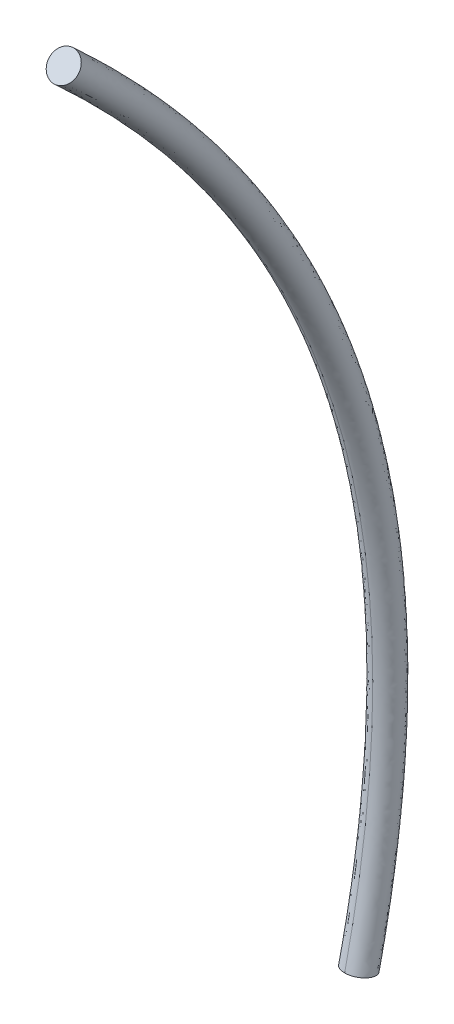
ISO-10303-21;
HEADER;
FILE_DESCRIPTION(('STEP AP214'),'2;1');
FILE_NAME('part.step','',(''),(''),'','','');
FILE_SCHEMA(('AUTOMOTIVE_DESIGN { 1 0 10303 214 1 1 1 1 }'));
ENDSEC;
DATA;
#1=APPLICATION_CONTEXT('core data for automotive mechanical design processes');
#2=APPLICATION_PROTOCOL_DEFINITION('international standard','automotive_design',2000,#1);
#3=PRODUCT_CONTEXT('',#1,'mechanical');
#4=PRODUCT('Part','Part','',(#3));
#5=PRODUCT_RELATED_PRODUCT_CATEGORY('part','',(#4));
#6=PRODUCT_DEFINITION_FORMATION('','',#4);
#7=PRODUCT_DEFINITION_CONTEXT('part definition',#1,'design');
#8=PRODUCT_DEFINITION('design','',#6,#7);
#9=PRODUCT_DEFINITION_SHAPE('','',#8);
#10=(LENGTH_UNIT() NAMED_UNIT(*) SI_UNIT(.MILLI.,.METRE.));
#11=(NAMED_UNIT(*) PLANE_ANGLE_UNIT() SI_UNIT($,.RADIAN.));
#12=(NAMED_UNIT(*) SI_UNIT($,.STERADIAN.) SOLID_ANGLE_UNIT());
#13=UNCERTAINTY_MEASURE_WITH_UNIT(LENGTH_MEASURE(1.E-05),#10,'distance_accuracy_value','');
#14=(GEOMETRIC_REPRESENTATION_CONTEXT(3) GLOBAL_UNCERTAINTY_ASSIGNED_CONTEXT((#13)) GLOBAL_UNIT_ASSIGNED_CONTEXT((#10,
#11,#12)) REPRESENTATION_CONTEXT('',''));
#15=CARTESIAN_POINT('',(0.,0.,0.));
#16=DIRECTION('',(0.,0.,1.));
#17=DIRECTION('',(1.,0.,0.));
#18=AXIS2_PLACEMENT_3D('',#15,#16,#17);
#19=CARTESIAN_POINT('',(-71.89158931535,31.2153070087,3.940002599999));
#20=DIRECTION('',(-3.37450176042513E-05,0.676622103447027,0.736330447549329));
#21=DIRECTION('',(0.,-0.736330447968568,0.67662210383227));
#22=AXIS2_PLACEMENT_3D('',#19,#20,#21);
#23=PLANE('',#22);
#24=CARTESIAN_POINT('',(-71.8915801262598,31.0312243970435,4.10915812606981));
#25=CARTESIAN_POINT('',(-71.9056443273846,31.0312149004336,4.10916620806537));
#26=CARTESIAN_POINT('',(-71.9197050075633,31.0320963525736,4.10835558766947));
#27=CARTESIAN_POINT('',(-71.9474187056116,31.0355763672693,4.1051564940145));
#28=CARTESIAN_POINT('',(-71.9610720142052,31.0381736730972,4.10276917556319));
#29=CARTESIAN_POINT('',(-71.9875982261411,31.0450223704149,4.09647461701565));
#30=CARTESIAN_POINT('',(-72.0004707642019,31.0492745293283,4.09256667174221));
#31=CARTESIAN_POINT('',(-72.0250612478118,31.0593084061478,4.08334530561743));
#32=CARTESIAN_POINT('',(-72.0367794195704,31.065089823559,4.07803216088385));
#33=CARTESIAN_POINT('',(-72.0587246528069,31.0780153155504,4.06615377917264));
#34=CARTESIAN_POINT('',(-72.0689526084492,31.0851585670084,4.05958929853001));
#35=CARTESIAN_POINT('',(-72.0876491179524,31.100618221931,4.04538239566298));
#36=CARTESIAN_POINT('',(-72.0961151845554,31.1089362564185,4.03773847478781));
#37=CARTESIAN_POINT('',(-72.1110187933412,31.1264893040948,4.02160810424195));
#38=CARTESIAN_POINT('',(-72.1174591050374,31.1357230424464,4.01312282590617));
#39=CARTESIAN_POINT('',(-72.1281517258305,31.1548682701707,3.99552957668017));
#40=CARTESIAN_POINT('',(-72.1324010741075,31.1647806562812,3.98642078190338));
#41=CARTESIAN_POINT('',(-72.1385756928086,31.1849834075447,3.96785596978209));
#42=CARTESIAN_POINT('',(-72.1405025254876,31.1952735138154,3.95840019025569));
#43=CARTESIAN_POINT('',(-72.1419826697084,31.2159459210752,3.93940402124288));
#44=CARTESIAN_POINT('',(-72.1415359811961,31.2263282220664,3.92986363175454));
#45=CARTESIAN_POINT('',(-72.1382806229167,31.2468972613656,3.91096266571314));
#46=CARTESIAN_POINT('',(-72.1354703630354,31.2570838632951,3.90160221455266));
#47=CARTESIAN_POINT('',(-72.1275710457406,31.2769512561954,3.88334621188929));
#48=CARTESIAN_POINT('',(-72.1224850600288,31.2866327093962,3.87445005171519));
#49=CARTESIAN_POINT('',(-72.1101707567415,31.3052429786498,3.85734943605592));
#50=CARTESIAN_POINT('',(-72.1029395068276,31.3141707428964,3.84914594722146));
#51=CARTESIAN_POINT('',(-72.0865543833166,31.3309930460379,3.83368849974252));
#52=CARTESIAN_POINT('',(-72.0774032097909,31.3388890109529,3.82643323058886));
#53=CARTESIAN_POINT('',(-72.0574175262046,31.3534488746673,3.81305492845842));
#54=CARTESIAN_POINT('',(-72.0465806739479,31.3601110304794,3.80693349723923));
#55=CARTESIAN_POINT('',(-72.0235569982175,31.3719916182258,3.79601735033321));
#56=CARTESIAN_POINT('',(-72.0113720903986,31.3772120629147,3.79122078501643));
#57=CARTESIAN_POINT('',(-71.9859679017957,31.3860806722069,3.78307248715765));
#58=CARTESIAN_POINT('',(-71.9727471268988,31.3897265144128,3.77972288876047));
#59=CARTESIAN_POINT('',(-71.9456784626663,31.3953250605954,3.77457956394699));
#60=CARTESIAN_POINT('',(-71.9318315653517,31.3972803505388,3.77278346121224));
#61=CARTESIAN_POINT('',(-71.9091402262477,31.3990498083704,3.77115852696657));
#62=CARTESIAN_POINT('',(-71.9003670645482,31.3993919319967,3.77084454788564));
#63=CARTESIAN_POINT('',(-71.8915984960603,31.3993896203589,3.77084707392642));
#64=B_SPLINE_CURVE_WITH_KNOTS('',3,(#24,#25,#26,#27,#28,#29,#30,#31,#32,#33,#34,#35,#36,#37,#38,
#39,#40,#41,#42,#43,#44,#45,#46,#47,#48,#49,#50,#51,#52,#53,#54,#55,#56,#57,#58,#59,#60,#61,#62,
#63),.UNSPECIFIED.,.F.,.F.,(4,2,2,2,2,2,2,2,2,2,2,2,2,2,2,2,2,2,2,4),(0.,0.0421365633205995,
0.0842422990850517,0.126367584327071,0.168484598210559,0.210576235899794,0.252726897181883,
0.294819679108901,0.336969196185549,0.379090345269686,0.421211495312277,0.463361005430821,
0.505453794314845,0.54760438657634,0.589696093299733,0.631846816301274,0.673938392261487,
0.716091839253722,0.758180691233902,0.784486372468564),.UNSPECIFIED.);
#65=CARTESIAN_POINT('',(-71.8915801262598,31.0312243970424,4.10915812607086));
#66=VERTEX_POINT('',#65);
#67=CARTESIAN_POINT('',(-71.8915984960602,31.399389620359,3.77084707392647));
#68=VERTEX_POINT('',#67);
#69=EDGE_CURVE('E45',#66,#68,#64,.T.);
#70=ORIENTED_EDGE('',*,*,#69,.F.);
#71=CARTESIAN_POINT('',(-71.8915984960602,31.3993896203588,3.77084707392657));
#72=CARTESIAN_POINT('',(-71.8775342949348,31.3993991166216,3.77083899224989));
#73=CARTESIAN_POINT('',(-71.8634736147962,31.3985176641347,3.77164961296458));
#74=CARTESIAN_POINT('',(-71.8357599169061,31.3950376487551,3.77484870724788));
#75=CARTESIAN_POINT('',(-71.8221066084305,31.3924403425903,3.77723602600874));
#76=CARTESIAN_POINT('',(-71.7955803968062,31.3855916446181,3.78353058515776));
#77=CARTESIAN_POINT('',(-71.7827078589387,31.3813394853871,3.78743853072311));
#78=CARTESIAN_POINT('',(-71.7581173757854,31.3713056079607,3.79665989740554));
#79=CARTESIAN_POINT('',(-71.7463992042898,31.3655241902603,3.80197304240488));
#80=CARTESIAN_POINT('',(-71.7244539716415,31.3525986977273,3.81385142461371));
#81=CARTESIAN_POINT('',(-71.7142260163241,31.3454554460169,3.82041590548823));
#82=CARTESIAN_POINT('',(-71.6955295075244,31.329995790633,3.83462280877912));
#83=CARTESIAN_POINT('',(-71.6870634412998,31.3216777559366,3.84226672984621));
#84=CARTESIAN_POINT('',(-71.672159833312,31.3041247078923,3.85839710073024));
#85=CARTESIAN_POINT('',(-71.6657195220354,31.2948909693814,3.86688237921238));
#86=CARTESIAN_POINT('',(-71.6550269021124,31.2757457413925,3.88447562868154));
#87=CARTESIAN_POINT('',(-71.6507775542859,31.2658333551766,3.89358442355505));
#88=CARTESIAN_POINT('',(-71.6446029365023,31.2456306037591,3.91214923581787));
#89=CARTESIAN_POINT('',(-71.6426761042904,31.2353404974395,3.92160501538915));
#90=CARTESIAN_POINT('',(-71.64119596101,31.2146680901405,3.94060118443796));
#91=CARTESIAN_POINT('',(-71.6416426499956,31.2042857891589,3.95014157391742));
#92=CARTESIAN_POINT('',(-71.644898009213,31.1837167499415,3.96904253988368));
#93=CARTESIAN_POINT('',(-71.6477082695581,31.173530148084,3.97840299097794));
#94=CARTESIAN_POINT('',(-71.6556075877559,31.1536627553838,3.99665899345747));
#95=CARTESIAN_POINT('',(-71.6606935739071,31.1439813023109,4.00555515351402));
#96=CARTESIAN_POINT('',(-71.6730078780396,31.1253710333622,4.02265576889293));
#97=CARTESIAN_POINT('',(-71.6802391283601,31.1164432692932,4.03085925756427));
#98=CARTESIAN_POINT('',(-71.6966242526374,31.0996209665542,4.04631670467328));
#99=CARTESIAN_POINT('',(-71.705775426523,31.0917250018642,4.0535719736202));
#100=CARTESIAN_POINT('',(-71.725761110773,31.0771651386414,4.06695027529876));
#101=CARTESIAN_POINT('',(-71.7365979633335,31.0705029830962,4.07307170627278));
#102=CARTESIAN_POINT('',(-71.759621639606,31.0586223959169,4.08398785265759));
#103=CARTESIAN_POINT('',(-71.7718065476633,31.0534019515283,4.0887844176984));
#104=CARTESIAN_POINT('',(-71.7972107366741,31.0445333428615,4.09693271498252));
#105=CARTESIAN_POINT('',(-71.8104315117407,31.0408875009812,4.10028231308053));
#106=CARTESIAN_POINT('',(-71.8375001762312,31.0352889554674,4.10542563727937));
#107=CARTESIAN_POINT('',(-71.8513470736336,31.0333336658662,4.10722173969975));
#108=CARTESIAN_POINT('',(-71.8740384072548,31.0315642090301,4.10884667303082));
#109=CARTESIAN_POINT('',(-71.8828115633552,31.0312220856245,4.10916065190926));
#110=CARTESIAN_POINT('',(-71.8915801262598,31.0312243970424,4.10915812607078));
#111=B_SPLINE_CURVE_WITH_KNOTS('',3,(#71,#72,#73,#74,#75,#76,#77,#78,#79,#80,#81,#82,#83,#84,
#85,#86,#87,#88,#89,#90,#91,#92,#93,#94,#95,#96,#97,#98,#99,#100,#101,#102,#103,#104,#105,#106,
#107,#108,#109,#110),.UNSPECIFIED.,.F.,.F.,(4,2,2,2,2,2,2,2,2,2,2,2,2,2,2,2,2,2,2,4),(0.,
0.0421365633209234,0.0842422990857341,0.126367584328106,0.168484598211904,0.210576235901267,
0.252726897183494,0.294819679112726,0.336969196191657,0.379090345281381,0.421211495329373,
0.463361005437342,0.505453794311043,0.547604386576201,0.589696093303109,0.631846816307703,
0.673938392269912,0.716091839276786,0.758180691241586,0.784486355748505),.UNSPECIFIED.);
#112=EDGE_CURVE('E55',#68,#66,#111,.T.);
#113=ORIENTED_EDGE('',*,*,#112,.F.);
#114=EDGE_LOOP('',(#70,#113));
#115=FACE_BOUND('',#114,.T.);
#116=ADVANCED_FACE('F17',(#115),#23,.T.);
#117=CARTESIAN_POINT('',(-71.87002391224,14.98605390699,-1.342334790154));
#118=CARTESIAN_POINT('',(-71.8700268062,15.04400323469,-1.356102106155));
#119=CARTESIAN_POINT('',(-71.8700989858,16.49070031074,-1.693639733297));
#120=CARTESIAN_POINT('',(-71.8702415241,19.34971998823,-2.04601594918));
#121=CARTESIAN_POINT('',(-71.87044644921,23.45838372434,-1.545610256692));
#122=CARTESIAN_POINT('',(-71.87065135057,27.56542786505,0.2350981041959));
#123=CARTESIAN_POINT('',(-71.87078170626,30.18008633194,2.434677965659));
#124=CARTESIAN_POINT('',(-71.87084647558,31.47919350202,3.859304224067));
#125=CARTESIAN_POINT('',(-71.870848474,31.51929646513,3.903618964022));
#126=CARTESIAN_POINT('',(-72.02577174002,14.98304695667,-1.354959032612));
#127=CARTESIAN_POINT('',(-72.02577460665,15.04103015516,-1.368734394157));
#128=CARTESIAN_POINT('',(-72.02584661256,16.48857880163,-1.70647071416));
#129=CARTESIAN_POINT('',(-72.02598961704,19.3495842148,-2.05912332778));
#130=CARTESIAN_POINT('',(-72.02619461114,23.46183882543,-1.558315207751));
#131=CARTESIAN_POINT('',(-72.02639915645,27.57253221778,0.2240131681018));
#132=CARTESIAN_POINT('',(-72.02652993483,30.18895999313,2.425160239104));
#133=CARTESIAN_POINT('',(-72.02659489563,31.4887846643,3.850573349312));
#134=CARTESIAN_POINT('',(-72.02659690733,31.52890961258,3.894912382511));
#135=CARTESIAN_POINT('',(-72.14078106085,15.00750160531,-1.251999709757));
#136=CARTESIAN_POINT('',(-72.14078389228,15.06520856445,-1.26570945439));
#137=CARTESIAN_POINT('',(-72.14085539221,16.50581207236,-1.601825298355));
#138=CARTESIAN_POINT('',(-72.14099786011,19.35062245415,-1.952223699582));
#139=CARTESIAN_POINT('',(-72.14120131233,23.43359102966,-1.454697651108));
#140=CARTESIAN_POINT('',(-72.14140397601,27.51452228174,0.3144183958182));
#141=CARTESIAN_POINT('',(-72.1415342817,30.11652013752,2.502783802223));
#142=CARTESIAN_POINT('',(-72.14159906562,31.41049309693,3.921779598371));
#143=CARTESIAN_POINT('',(-72.14160107738,31.45043874119,3.965920503576));
#144=CARTESIAN_POINT('',(-72.14078286247,15.04362589287,-1.099944365016));
#145=CARTESIAN_POINT('',(-72.14078567355,15.10092488826,-1.113557203394));
#146=CARTESIAN_POINT('',(-72.14085666194,16.53127147712,-1.447279849389));
#147=CARTESIAN_POINT('',(-72.140997937,19.35216424749,-1.794349119916));
#148=CARTESIAN_POINT('',(-72.14119923217,23.39188177935,-1.301670194635));
#149=CARTESIAN_POINT('',(-72.14139970373,27.42885885248,0.4479332411541));
#150=CARTESIAN_POINT('',(-72.1415289466,30.00954589994,2.617422062488));
#151=CARTESIAN_POINT('',(-72.14159329951,31.2948767663,4.026940456544));
#152=CARTESIAN_POINT('',(-72.14159529807,31.33455760566,4.070788756676));
#153=CARTESIAN_POINT('',(-72.14078466409,15.07975018042,-0.9478890202743));
#154=CARTESIAN_POINT('',(-72.14078745482,15.13664121208,-0.9614049523993));
#155=CARTESIAN_POINT('',(-72.14085793167,16.55673088189,-1.292734400423));
#156=CARTESIAN_POINT('',(-72.1409980139,19.35370604083,-1.636474540251));
#157=CARTESIAN_POINT('',(-72.14119715202,23.35017252904,-1.148642738162));
#158=CARTESIAN_POINT('',(-72.14139543146,27.34319542322,0.5814480864901));
#159=CARTESIAN_POINT('',(-72.1415236115,29.90257166236,2.732060322752));
#160=CARTESIAN_POINT('',(-72.14158753341,31.17926043567,4.132101314717));
#161=CARTESIAN_POINT('',(-72.14158951875,31.21867647013,4.175657009775));
#162=CARTESIAN_POINT('',(-72.02577778307,15.10421630061,-0.8449296974196));
#163=CARTESIAN_POINT('',(-72.02578058145,15.16083109291,-0.8583800126319));
#164=CARTESIAN_POINT('',(-72.02585087154,16.57397562414,-1.188088984618));
#165=CARTESIAN_POINT('',(-72.02598987496,19.35475575173,-1.529574912053));
#166=CARTESIAN_POINT('',(-72.02618763381,23.32193620482,-1.045025181519));
#167=CARTESIAN_POINT('',(-72.02638482624,27.2851969587,0.6718533142066));
#168=CARTESIAN_POINT('',(-72.02651203965,29.83014327827,2.809683885871));
#169=CARTESIAN_POINT('',(-72.02657555475,31.10098033984,4.203307563776));
#170=CARTESIAN_POINT('',(-72.02657752216,31.14021707029,4.24666513084));
#171=CARTESIAN_POINT('',(-71.87002965614,15.10122488546,-0.8575539398773));
#172=CARTESIAN_POINT('',(-71.87003248523,15.15787354854,-0.8710123006341));
#173=CARTESIAN_POINT('',(-71.87010303394,16.57186965018,-1.200919965481));
#174=CARTESIAN_POINT('',(-71.87024176925,19.35463551347,-1.542682290652));
#175=CARTESIAN_POINT('',(-71.87043981728,23.32540684107,-1.057730132578));
#176=CARTESIAN_POINT('',(-71.87063772977,27.29231684653,0.6607683781125));
#177=CARTESIAN_POINT('',(-71.87076469696,29.83903247461,2.800166159316));
#178=CARTESIAN_POINT('',(-71.87082809216,31.11058703729,4.194576689022));
#179=CARTESIAN_POINT('',(-71.87083004847,31.1498457529,4.237958549329));
#180=(BOUNDED_SURFACE() B_SPLINE_SURFACE(3,3,((#117,#118,#119,#120,#121,#122,#123,#124,#125),
(#126,#127,#128,#129,#130,#131,#132,#133,#134),(#135,#136,#137,#138,#139,#140,#141,#142,#143),
(#144,#145,#146,#147,#148,#149,#150,#151,#152),(#153,#154,#155,#156,#157,#158,#159,#160,#161),
(#162,#163,#164,#165,#166,#167,#168,#169,#170),(#171,#172,#173,#174,#175,#176,#177,#178,#179)),
.UNSPECIFIED.,.F.,.F.,.F.) B_SPLINE_SURFACE_WITH_KNOTS((4,3,4),(4,1,1,1,1,1,4),(0.,1.,2.),
(-0.009156590736132,0.,0.2197220715086,0.4577543156428,0.7180322441343,1.,1.008999404034),
.UNSPECIFIED.) GEOMETRIC_REPRESENTATION_ITEM() RATIONAL_B_SPLINE_SURFACE(((1.192522345281,
1.192522345281,1.192522345281,1.192522345281,1.192522345281,1.192522345281,1.192522345281,
1.192522345281,1.192522345281),(0.9358258849064,0.9358258849064,0.9358258849064,0.9358258849064,
0.9358258849064,0.9358258849064,0.9358258849064,0.9358258849064,0.9358258849064),
(0.9358258849064,0.9358258849064,0.9358258849064,0.9358258849064,0.9358258849064,
0.9358258849064,0.9358258849064,0.9358258849064,0.9358258849064),(1.192522345281,1.192522345281,
1.192522345281,1.192522345281,1.192522345281,1.192522345281,1.192522345281,1.192522345281,
1.192522345281),(0.9358258849064,0.9358258849064,0.9358258849064,0.9358258849064,
0.9358258849064,0.9358258849064,0.9358258849064,0.9358258849064,0.9358258849064),
(0.9358258849064,0.9358258849064,0.9358258849064,0.9358258849064,0.9358258849064,
0.9358258849064,0.9358258849064,0.9358258849064,0.9358258849064),(1.192522345281,1.192522345281,
1.192522345281,1.192522345281,1.192522345281,1.192522345281,1.192522345281,1.192522345281,1.192522345281))) REPRESENTATION_ITEM('') SURFACE());
#181=CARTESIAN_POINT('',(-71.890779907569,14.9858533719425,-1.34317453056112));
#182=CARTESIAN_POINT('',(-71.8907827977688,15.0438049526718,-1.35694238173625));
#183=CARTESIAN_POINT('',(-71.8908549513794,16.4905586735526,-1.69449322554648));
#184=CARTESIAN_POINT('',(-71.8909975451988,19.3497104383676,-2.0468878268771));
#185=CARTESIAN_POINT('',(-71.8912024675444,23.4586130325736,-1.54645536568052));
#186=CARTESIAN_POINT('',(-71.8914073093149,27.5658999145033,0.23436075549721));
#187=CARTESIAN_POINT('',(-71.8915377154422,30.1806760724028,2.43404486473446));
#188=CARTESIAN_POINT('',(-71.8916025078937,31.4798309692726,3.8587234630157));
#189=CARTESIAN_POINT('',(-71.8916045080126,31.5199353947934,3.90303981891079));
#190=(BOUNDED_CURVE() B_SPLINE_CURVE(3,(#181,#182,#183,#184,#185,#186,#187,#188,#189),
.UNSPECIFIED.,.F.,.F.) B_SPLINE_CURVE_WITH_KNOTS((4,1,1,1,1,1,4),(-0.009156590736132,0.,
0.2197220715086,0.4577543156428,0.7180322441343,1.,1.008999404034),
.UNSPECIFIED.) CURVE() GEOMETRIC_REPRESENTATION_ITEM() RATIONAL_B_SPLINE_CURVE((1.15215670108335,
1.15215670108335,1.15215670108335,1.15215670108335,1.15215670108335,1.15215670108335,
1.15215670108335,1.15215670108335,1.15215670108335)) REPRESENTATION_ITEM(''));
#191=CARTESIAN_POINT('',(-71.8907885673597,15.1594911593599,-1.38368693349311));
#192=VERTEX_POINT('',#191);
#193=EDGE_CURVE('E49',#192,#68,#190,.T.);
#194=CARTESIAN_POINT('',(-71.8907885673597,15.1594911593632,-1.3836869334947));
#195=CARTESIAN_POINT('',(-71.9048527687919,15.15948779125,-1.38369857615242));
#196=CARTESIAN_POINT('',(-71.9189134182761,15.159754568705,-1.38253077638536));
#197=CARTESIAN_POINT('',(-71.946626995187,15.1608087845149,-1.37792208394767));
#198=CARTESIAN_POINT('',(-71.9602802133815,15.161595841806,-1.37448285492095));
#199=CARTESIAN_POINT('',(-71.986806186964,15.163671520441,-1.3654147610872));
#200=CARTESIAN_POINT('',(-71.9996785770441,15.1649603744888,-1.35978488038487));
#201=CARTESIAN_POINT('',(-72.0242687114711,15.168001901784,-1.34650035697848));
#202=CARTESIAN_POINT('',(-72.035986682038,15.1697544839101,-1.33884611205631));
#203=CARTESIAN_POINT('',(-72.0579314654775,15.1736728725875,-1.32173382795443));
#204=CARTESIAN_POINT('',(-72.0681591725431,15.175838429528,-1.31227687836923));
#205=CARTESIAN_POINT('',(-72.0868551440743,15.1805253171092,-1.29181007059703));
#206=CARTESIAN_POINT('',(-72.0953209212254,15.1830471423802,-1.28079805341767));
#207=CARTESIAN_POINT('',(-72.1102239192026,15.188368901413,-1.25756025180806));
#208=CARTESIAN_POINT('',(-72.1166639095867,15.1911684485338,-1.24533615483112));
#209=CARTESIAN_POINT('',(-72.1273558641763,15.1969731203468,-1.21999089502601));
#210=CARTESIAN_POINT('',(-72.1316048675304,15.1999785170427,-1.20686854528706));
#211=CARTESIAN_POINT('',(-72.1377787832379,15.2061039985776,-1.18012362867366));
#212=CARTESIAN_POINT('',(-72.1397052578551,15.2092240048663,-1.16650140440561));
#213=CARTESIAN_POINT('',(-72.1411846827474,15.2154920543588,-1.13913506479675));
#214=CARTESIAN_POINT('',(-72.1407376329686,15.2186400975632,-1.12539094945316));
#215=CARTESIAN_POINT('',(-72.1374815589649,15.2248769692813,-1.09816176170017));
#216=CARTESIAN_POINT('',(-72.134670944631,15.2279657564986,-1.08467686993438));
#217=CARTESIAN_POINT('',(-72.1267709360364,15.2339900426686,-1.05837683214443));
#218=CARTESIAN_POINT('',(-72.1216846134542,15.2369257423099,-1.04556080925375));
#219=CARTESIAN_POINT('',(-72.1093696626185,15.2425690081755,-1.02092525000941));
#220=CARTESIAN_POINT('',(-72.1021381020628,15.2452762555825,-1.00910710623638));
#221=CARTESIAN_POINT('',(-72.0857523932241,15.2503775319207,-0.986838734862254));
#222=CARTESIAN_POINT('',(-72.0766009449627,15.252771993143,-0.976386619309901));
#223=CARTESIAN_POINT('',(-72.0566147547794,15.2571873980949,-0.957113515023655));
#224=CARTESIAN_POINT('',(-72.0457776707218,15.2592078134128,-0.94829483382047));
#225=CARTESIAN_POINT('',(-72.0227535816285,15.2628109380157,-0.932568769875189));
#226=CARTESIAN_POINT('',(-72.0105684921774,15.2643942575232,-0.925658722511462));
#227=CARTESIAN_POINT('',(-71.9851639950201,15.2670841998864,-0.913920088784222));
#228=CARTESIAN_POINT('',(-71.9719430932817,15.2681901186174,-0.909094576921648));
#229=CARTESIAN_POINT('',(-71.9448742342845,15.2698885997611,-0.90168497994577));
#230=CARTESIAN_POINT('',(-71.931027268957,15.2704819462329,-0.89909747144996));
#231=CARTESIAN_POINT('',(-71.9083358711098,15.2710192535863,-0.896756552988884));
#232=CARTESIAN_POINT('',(-71.8995627003351,15.2711232940351,-0.896304227436635));
#233=CARTESIAN_POINT('',(-71.8907941347414,15.2711228978363,-0.896307866509311));
#234=B_SPLINE_CURVE_WITH_KNOTS('',3,(#194,#195,#196,#197,#198,#199,#200,#201,#202,#203,#204,
#205,#206,#207,#208,#209,#210,#211,#212,#213,#214,#215,#216,#217,#218,#219,#220,#221,#222,#223,
#224,#225,#226,#227,#228,#229,#230,#231,#232,#233),.UNSPECIFIED.,.F.,.F.,(4,2,2,2,2,2,2,2,2,2,2,
2,2,2,2,2,2,2,2,4),(0.,0.0421365633245313,0.0842422990930301,0.126367584339202,0.16848459822676,
0.210576235917995,0.252726897202081,0.294819679129693,0.336969196206953,0.379090345292431,
0.421211495336278,0.463361005448981,0.505453794327285,0.547604386590573,0.589696093315708,
0.631846816319492,0.673938392281418,0.716091839282176,0.75818069125582,0.784486364105919),.UNSPECIFIED.);
#235=CARTESIAN_POINT('',(-71.8907941347413,15.2711228978318,-0.896307866508642));
#236=VERTEX_POINT('',#235);
#237=EDGE_CURVE('E38',#192,#236,#234,.T.);
#238=CARTESIAN_POINT('',(-71.8915860186509,31.1492047529161,4.23853769444021));
#239=CARTESIAN_POINT('',(-71.8915840607788,31.1099474997154,4.19515745007317));
#240=CARTESIAN_POINT('',(-71.8915206472169,29.8384406638328,2.80079926024054));
#241=CARTESIAN_POINT('',(-71.8913936413274,27.2918427267695,0.661505726811191));
#242=CARTESIAN_POINT('',(-71.8911958126484,23.3251754625245,-1.05688502358948));
#243=CARTESIAN_POINT('',(-71.8909977911999,19.3546429930145,-1.54181041295502));
#244=CARTESIAN_POINT('',(-71.8908590135458,16.5720092170528,-1.20006647323152));
#245=CARTESIAN_POINT('',(-71.8907884964753,15.1580697602464,-0.870172025052822));
#246=CARTESIAN_POINT('',(-71.8907856713603,15.1014233501857,-0.856714199470218));
#247=(BOUNDED_CURVE() B_SPLINE_CURVE(3,(#238,#239,#240,#241,#242,#243,#244,#245,#246),
.UNSPECIFIED.,.F.,.F.) B_SPLINE_CURVE_WITH_KNOTS((4,1,1,1,1,1,4),(-0.00915659073613195,
-0.00015718670213194,0.281810569163568,0.542088497655068,0.780120741789268,0.999842813297868,
1.008999404034),
.UNSPECIFIED.) CURVE() GEOMETRIC_REPRESENTATION_ITEM() RATIONAL_B_SPLINE_CURVE((1.15215670108609,
1.15215670108609,1.15215670108609,1.15215670108609,1.15215670108609,1.15215670108609,
1.15215670108609,1.15215670108609,1.15215670108609)) REPRESENTATION_ITEM(''));
#248=EDGE_CURVE('E30',#66,#236,#247,.T.);
#249=ORIENTED_EDGE('',*,*,#193,.F.);
#250=ORIENTED_EDGE('',*,*,#237,.T.);
#251=ORIENTED_EDGE('',*,*,#248,.F.);
#252=ORIENTED_EDGE('',*,*,#69,.T.);
#253=EDGE_LOOP('',(#249,#250,#251,#252));
#254=FACE_BOUND('',#253,.T.);
#255=ADVANCED_FACE('F47',(#254),#180,.T.);
#256=CARTESIAN_POINT('',(-71.89079135105,15.2153070286,-1.139997400001));
#257=DIRECTION('',(-4.86138868151115E-05,0.974758132756431,-0.223263477223407));
#258=DIRECTION('',(0.,0.223263477487227,0.974758133908258));
#259=AXIS2_PLACEMENT_3D('',#256,#257,#258);
#260=PLANE('',#259);
#261=CARTESIAN_POINT('',(-71.8907941347413,15.2711228978363,-0.896307866509489));
#262=CARTESIAN_POINT('',(-71.8767299333103,15.2711262659496,-0.896296223851297));
#263=CARTESIAN_POINT('',(-71.8626692838272,15.2708594884948,-0.897464023617838));
#264=CARTESIAN_POINT('',(-71.8349557069185,15.2698052726851,-0.902072716054349));
#265=CARTESIAN_POINT('',(-71.8213024887252,15.2690182153941,-0.905511945080398));
#266=CARTESIAN_POINT('',(-71.7947765151446,15.2669425367595,-0.914580038912587));
#267=CARTESIAN_POINT('',(-71.7819041250656,15.2656536827119,-0.920209919614017));
#268=CARTESIAN_POINT('',(-71.7573139906403,15.2626121554172,-0.933494443018438));
#269=CARTESIAN_POINT('',(-71.7455960200741,15.2608595732913,-0.94114868793953));
#270=CARTESIAN_POINT('',(-71.7236512366353,15.2569411846144,-0.958260972039328));
#271=CARTESIAN_POINT('',(-71.7134235295697,15.2547756276741,-0.96771792162359));
#272=CARTESIAN_POINT('',(-71.6947275580384,15.2500887400934,-0.988184729393901));
#273=CARTESIAN_POINT('',(-71.6862617808872,15.2475669148225,-0.999196746572326));
#274=CARTESIAN_POINT('',(-71.6713587829089,15.2422451557901,-1.02243454818049));
#275=CARTESIAN_POINT('',(-71.664918792524,15.2394456086694,-1.03465864515698));
#276=CARTESIAN_POINT('',(-71.6542268379329,15.2336409368565,-1.06000390496131));
#277=CARTESIAN_POINT('',(-71.6499778345779,15.2306355401607,-1.07312625469994));
#278=CARTESIAN_POINT('',(-71.6438039188687,15.2245100586259,-1.09987117131309));
#279=CARTESIAN_POINT('',(-71.6418774442507,15.2213900523372,-1.11349339558122));
#280=CARTESIAN_POINT('',(-71.640398019356,15.2151220028446,-1.14085973519039));
#281=CARTESIAN_POINT('',(-71.6408450691332,15.2119739596401,-1.15460385053421));
#282=CARTESIAN_POINT('',(-71.644101143134,15.2057370879214,-1.18183303829009));
#283=CARTESIAN_POINT('',(-71.646911757467,15.2026483007034,-1.19531793005851));
#284=CARTESIAN_POINT('',(-71.654811766061,15.1966240145323,-1.22161796785355));
#285=CARTESIAN_POINT('',(-71.6598980886433,15.1936883148905,-1.2344339907467));
#286=CARTESIAN_POINT('',(-71.6722130394787,15.1880450490245,-1.25906954999268));
#287=CARTESIAN_POINT('',(-71.6794446000335,15.1853378016176,-1.27088769376513));
#288=CARTESIAN_POINT('',(-71.6958303088703,15.1802365252796,-1.29315606513823));
#289=CARTESIAN_POINT('',(-71.7049817571307,15.1778420640574,-1.30360818069015));
#290=CARTESIAN_POINT('',(-71.724967947312,15.1734266591057,-1.32288128497575));
#291=CARTESIAN_POINT('',(-71.7358050313684,15.1714062437878,-1.33169996617872));
#292=CARTESIAN_POINT('',(-71.7588291204595,15.167803119185,-1.34742603012377));
#293=CARTESIAN_POINT('',(-71.7710142099096,15.1662197996775,-1.35433607748748));
#294=CARTESIAN_POINT('',(-71.7964187070648,15.1635298573142,-1.36607471121503));
#295=CARTESIAN_POINT('',(-71.8096396088023,15.1624239385831,-1.3709002230779));
#296=CARTESIAN_POINT('',(-71.8367084677978,15.1607254574393,-1.37830982005454));
#297=CARTESIAN_POINT('',(-71.8505554331244,15.1601321109674,-1.38089732855082));
#298=CARTESIAN_POINT('',(-71.8732468309775,15.1595948036136,-1.38323824701357));
#299=CARTESIAN_POINT('',(-71.8820200017591,15.1594907631647,-1.38369057256622));
#300=CARTESIAN_POINT('',(-71.8907885673596,15.1594911593636,-1.38368693349323));
#301=B_SPLINE_CURVE_WITH_KNOTS('',3,(#261,#262,#263,#264,#265,#266,#267,#268,#269,#270,#271,
#272,#273,#274,#275,#276,#277,#278,#279,#280,#281,#282,#283,#284,#285,#286,#287,#288,#289,#290,
#291,#292,#293,#294,#295,#296,#297,#298,#299,#300),.UNSPECIFIED.,.F.,.F.,(4,2,2,2,2,2,2,2,2,2,2,
2,2,2,2,2,2,2,2,4),(0.,0.0421365633210063,0.0842422990858654,0.126367584328292,
0.168484598212173,0.210576235901405,0.252726897183484,0.294819679110908,0.336969196187984,
0.379090345274088,0.421211495318593,0.463361005438539,0.505453794323987,0.547604386584285,
0.589696093306484,0.631846816307393,0.673938392266439,0.716091839264939,0.758180691236392,
0.784486364106955),.UNSPECIFIED.);
#302=EDGE_CURVE('E11',#236,#192,#301,.T.);
#303=ORIENTED_EDGE('',*,*,#302,.F.);
#304=ORIENTED_EDGE('',*,*,#237,.F.);
#305=EDGE_LOOP('',(#303,#304));
#306=FACE_BOUND('',#305,.T.);
#307=ADVANCED_FACE('F78',(#306),#260,.F.);
#308=CARTESIAN_POINT('',(-71.91154166667,15.10122281514,-0.8575539398773));
#309=CARTESIAN_POINT('',(-71.91154448803,15.15787147822,-0.8710123006341));
#310=CARTESIAN_POINT('',(-71.91161497912,16.57186757986,-1.200919965481));
#311=CARTESIAN_POINT('',(-71.91175381229,19.35463344315,-1.542682290652));
#312=CARTESIAN_POINT('',(-71.91195183098,23.32540477075,-1.057730132578));
#313=CARTESIAN_POINT('',(-71.91214960006,27.29231477622,0.6607683781125));
#314=CARTESIAN_POINT('',(-71.91227665639,29.83903040429,2.800166159316));
#315=CARTESIAN_POINT('',(-71.91234009308,31.11058496697,4.194576689022));
#316=CARTESIAN_POINT('',(-71.91234205265,31.14984368258,4.237958549329));
#317=CARTESIAN_POINT('',(-71.7557938389,15.10422976546,-0.8449296974196));
#318=CARTESIAN_POINT('',(-71.75579668759,15.16084455776,-0.8583800126319));
#319=CARTESIAN_POINT('',(-71.75586735236,16.57398908897,-1.188088984618));
#320=CARTESIAN_POINT('',(-71.75600571935,19.35476921659,-1.529574912053));
#321=CARTESIAN_POINT('',(-71.75620366904,23.32194966967,-1.045025181519));
#322=CARTESIAN_POINT('',(-71.75640179418,27.2852104235,0.6718533142066));
#323=CARTESIAN_POINT('',(-71.75652842782,29.8301567431,2.809683885871));
#324=CARTESIAN_POINT('',(-71.75659167304,31.10099380468,4.203307563776));
#325=CARTESIAN_POINT('',(-71.75659361932,31.14023053514,4.24666513084));
#326=CARTESIAN_POINT('',(-71.64078451806,15.07977511681,-0.9478890202743));
#327=CARTESIAN_POINT('',(-71.64078740196,15.13666614847,-0.9614049523993));
#328=CARTESIAN_POINT('',(-71.64085857271,16.55675581824,-1.292734400423));
#329=CARTESIAN_POINT('',(-71.64099747628,19.35373097724,-1.636474540251));
#330=CARTESIAN_POINT('',(-71.64119696785,23.35019746543,-1.148642738162));
#331=CARTESIAN_POINT('',(-71.64139697462,27.34322035953,0.5814480864902));
#332=CARTESIAN_POINT('',(-71.64152408095,29.90259659872,2.732060322752));
#333=CARTESIAN_POINT('',(-71.64158750305,31.17928537205,4.132101314717));
#334=CARTESIAN_POINT('',(-71.64158944927,31.21870140652,4.175657009775));
#335=CARTESIAN_POINT('',(-71.64078271644,15.04365082926,-1.099944365016));
#336=CARTESIAN_POINT('',(-71.64078562069,15.10094982465,-1.113557203394));
#337=CARTESIAN_POINT('',(-71.64085730298,16.53129641348,-1.447279849389));
#338=CARTESIAN_POINT('',(-71.64099739939,19.3521891839,-1.794349119916));
#339=CARTESIAN_POINT('',(-71.64119904801,23.39190671574,-1.301670194635));
#340=CARTESIAN_POINT('',(-71.6414012469,27.42888378879,0.4479332411542));
#341=CARTESIAN_POINT('',(-71.64152941605,30.0095708363,2.617422062487));
#342=CARTESIAN_POINT('',(-71.64159326915,31.29490170268,4.026940456544));
#343=CARTESIAN_POINT('',(-71.64159522859,31.33458254205,4.070788756676));
#344=CARTESIAN_POINT('',(-71.64078091483,15.0075265417,-1.251999709757));
#345=CARTESIAN_POINT('',(-71.64078383941,15.06523350084,-1.26570945439));
#346=CARTESIAN_POINT('',(-71.64085603325,16.50583700871,-1.601825298355));
#347=CARTESIAN_POINT('',(-71.64099732249,19.35064739056,-1.952223699582));
#348=CARTESIAN_POINT('',(-71.64120112816,23.43361596605,-1.454697651108));
#349=CARTESIAN_POINT('',(-71.64140551917,27.51454721805,0.3144183958183));
#350=CARTESIAN_POINT('',(-71.64153475115,30.11654507388,2.502783802223));
#351=CARTESIAN_POINT('',(-71.64159903526,31.41051803331,3.921779598371));
#352=CARTESIAN_POINT('',(-71.6416010079,31.45046367758,3.965920503576));
#353=CARTESIAN_POINT('',(-71.75578779585,14.98306042151,-1.354959032612));
#354=CARTESIAN_POINT('',(-71.75579071278,15.04104362,-1.368734394157));
#355=CARTESIAN_POINT('',(-71.75586309338,16.48859226646,-1.70647071416));
#356=CARTESIAN_POINT('',(-71.75600546143,19.34959767966,-2.05912332778));
#357=CARTESIAN_POINT('',(-71.75621064638,23.46185229027,-1.558315207751));
#358=CARTESIAN_POINT('',(-71.75641612439,27.57254568258,0.2240131681018));
#359=CARTESIAN_POINT('',(-71.756546323,30.18897345796,2.425160239104));
#360=CARTESIAN_POINT('',(-71.75661101391,31.48879812915,3.850573349312));
#361=CARTESIAN_POINT('',(-71.75661300449,31.52892307742,3.894912382511));
#362=CARTESIAN_POINT('',(-71.91153592278,14.98605183667,-1.342334790154));
#363=CARTESIAN_POINT('',(-71.911538809,15.04400116438,-1.356102106155));
#364=CARTESIAN_POINT('',(-71.91161093098,16.49069824043,-1.693639733297));
#365=CARTESIAN_POINT('',(-71.91175356714,19.34971791791,-2.04601594918));
#366=CARTESIAN_POINT('',(-71.9119584629,23.45838165403,-1.545610256692));
#367=CARTESIAN_POINT('',(-71.91216322086,27.56542579474,0.2350981041959));
#368=CARTESIAN_POINT('',(-71.91229366569,30.18008426163,2.434677965659));
#369=CARTESIAN_POINT('',(-71.91235847651,31.4791914317,3.859304224067));
#370=CARTESIAN_POINT('',(-71.91236047818,31.51929439481,3.903618964022));
#371=(BOUNDED_SURFACE() B_SPLINE_SURFACE(3,3,((#308,#309,#310,#311,#312,#313,#314,#315,#316),
(#317,#318,#319,#320,#321,#322,#323,#324,#325),(#326,#327,#328,#329,#330,#331,#332,#333,#334),
(#335,#336,#337,#338,#339,#340,#341,#342,#343),(#344,#345,#346,#347,#348,#349,#350,#351,#352),
(#353,#354,#355,#356,#357,#358,#359,#360,#361),(#362,#363,#364,#365,#366,#367,#368,#369,#370)),
.UNSPECIFIED.,.F.,.F.,.F.) B_SPLINE_SURFACE_WITH_KNOTS((4,3,4),(4,1,1,1,1,1,4),(0.,1.,2.),
(-0.009156590736132,0.,0.2197220715086,0.4577543156428,0.7180322441343,1.,1.008999404034),
.UNSPECIFIED.) GEOMETRIC_REPRESENTATION_ITEM() RATIONAL_B_SPLINE_SURFACE(((1.192522345281,
1.192522345281,1.192522345281,1.192522345281,1.192522345281,1.192522345281,1.192522345281,
1.192522345281,1.192522345281),(0.9358258849064,0.9358258849064,0.9358258849064,0.9358258849064,
0.9358258849064,0.9358258849064,0.9358258849064,0.9358258849064,0.9358258849064),
(0.9358258849064,0.9358258849064,0.9358258849064,0.9358258849064,0.9358258849064,
0.9358258849064,0.9358258849064,0.9358258849064,0.9358258849064),(1.192522345281,1.192522345281,
1.192522345281,1.192522345281,1.192522345281,1.192522345281,1.192522345281,1.192522345281,
1.192522345281),(0.9358258849064,0.9358258849064,0.9358258849064,0.9358258849064,
0.9358258849064,0.9358258849064,0.9358258849064,0.9358258849064,0.9358258849064),
(0.9358258849064,0.9358258849064,0.9358258849064,0.9358258849064,0.9358258849064,
0.9358258849064,0.9358258849064,0.9358258849064,0.9358258849064),(1.192522345281,1.192522345281,
1.192522345281,1.192522345281,1.192522345281,1.192522345281,1.192522345281,1.192522345281,1.192522345281))) REPRESENTATION_ITEM('') SURFACE());
#372=ORIENTED_EDGE('',*,*,#248,.T.);
#373=ORIENTED_EDGE('',*,*,#302,.T.);
#374=ORIENTED_EDGE('',*,*,#193,.T.);
#375=ORIENTED_EDGE('',*,*,#112,.T.);
#376=EDGE_LOOP('',(#372,#373,#374,#375));
#377=FACE_BOUND('',#376,.T.);
#378=ADVANCED_FACE('F59',(#377),#371,.T.);
#379=CLOSED_SHELL('',(#116,#255,#307,#378));
#380=MANIFOLD_SOLID_BREP('B1',#379);
#381=ADVANCED_BREP_SHAPE_REPRESENTATION('',(#18,#380),#14);
#382=SHAPE_DEFINITION_REPRESENTATION(#9,#381);
ENDSEC;
END-ISO-10303-21;
